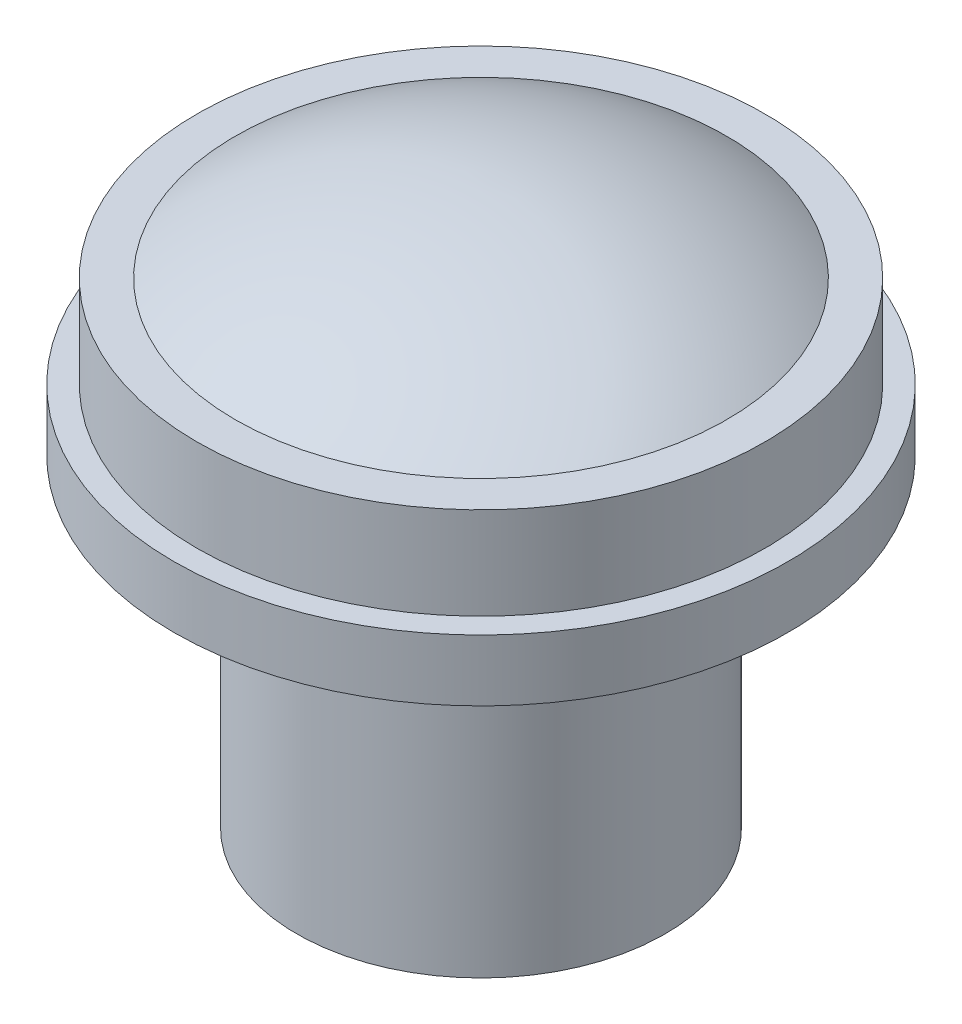
ISO-10303-21;
HEADER;
FILE_DESCRIPTION(('STEP AP214'),'2;1');
FILE_NAME('part.step','',(''),(''),'','','');
FILE_SCHEMA(('AUTOMOTIVE_DESIGN { 1 0 10303 214 1 1 1 1 }'));
ENDSEC;
DATA;
#1=APPLICATION_CONTEXT('core data for automotive mechanical design processes');
#2=APPLICATION_PROTOCOL_DEFINITION('international standard','automotive_design',2000,#1);
#3=PRODUCT_CONTEXT('',#1,'mechanical');
#4=PRODUCT('Part','Part','',(#3));
#5=PRODUCT_RELATED_PRODUCT_CATEGORY('part','',(#4));
#6=PRODUCT_DEFINITION_FORMATION('','',#4);
#7=PRODUCT_DEFINITION_CONTEXT('part definition',#1,'design');
#8=PRODUCT_DEFINITION('design','',#6,#7);
#9=PRODUCT_DEFINITION_SHAPE('','',#8);
#10=(LENGTH_UNIT() NAMED_UNIT(*) SI_UNIT(.MILLI.,.METRE.));
#11=(NAMED_UNIT(*) PLANE_ANGLE_UNIT() SI_UNIT($,.RADIAN.));
#12=(NAMED_UNIT(*) SI_UNIT($,.STERADIAN.) SOLID_ANGLE_UNIT());
#13=UNCERTAINTY_MEASURE_WITH_UNIT(LENGTH_MEASURE(1.E-05),#10,'distance_accuracy_value','');
#14=(GEOMETRIC_REPRESENTATION_CONTEXT(3) GLOBAL_UNCERTAINTY_ASSIGNED_CONTEXT((#13)) GLOBAL_UNIT_ASSIGNED_CONTEXT((#10,
#11,#12)) REPRESENTATION_CONTEXT('',''));
#15=CARTESIAN_POINT('',(0.,0.,0.));
#16=DIRECTION('',(0.,0.,1.));
#17=DIRECTION('',(1.,0.,0.));
#18=AXIS2_PLACEMENT_3D('',#15,#16,#17);
#19=CARTESIAN_POINT('',(0.,12.5,0.));
#20=DIRECTION('',(0.,-1.,0.));
#21=DIRECTION('',(0.,0.,-1.));
#22=AXIS2_PLACEMENT_3D('',#19,#20,#21);
#23=CYLINDRICAL_SURFACE('',#22,9.25);
#24=CARTESIAN_POINT('',(0.,12.5,0.));
#25=DIRECTION('',(0.,1.,0.));
#26=DIRECTION('',(0.,0.,1.));
#27=AXIS2_PLACEMENT_3D('',#24,#25,#26);
#28=CIRCLE('',#27,9.25);
#29=CARTESIAN_POINT('',(0.,12.5,9.25));
#30=VERTEX_POINT('',#29);
#31=EDGE_CURVE('E84',#30,#30,#28,.T.);
#32=ORIENTED_EDGE('',*,*,#31,.T.);
#33=EDGE_LOOP('',(#32));
#34=FACE_BOUND('',#33,.T.);
#35=CARTESIAN_POINT('',(0.,10.5,0.));
#36=DIRECTION('',(0.,1.,0.));
#37=DIRECTION('',(0.,0.,1.));
#38=AXIS2_PLACEMENT_3D('',#35,#36,#37);
#39=CIRCLE('',#38,9.25);
#40=CARTESIAN_POINT('',(0.,10.5,9.25));
#41=VERTEX_POINT('',#40);
#42=EDGE_CURVE('E90',#41,#41,#39,.T.);
#43=ORIENTED_EDGE('',*,*,#42,.F.);
#44=EDGE_LOOP('',(#43));
#45=FACE_BOUND('',#44,.T.);
#46=ADVANCED_FACE('F77',(#34,#45),#23,.F.);
#47=CARTESIAN_POINT('',(0.,12.5,0.));
#48=DIRECTION('',(0.,-1.,0.));
#49=DIRECTION('',(0.,0.,-1.));
#50=AXIS2_PLACEMENT_3D('',#47,#48,#49);
#51=CYLINDRICAL_SURFACE('',#50,10.);
#52=CARTESIAN_POINT('',(0.,12.5,0.));
#53=DIRECTION('',(0.,1.,0.));
#54=DIRECTION('',(0.,0.,1.));
#55=AXIS2_PLACEMENT_3D('',#52,#53,#54);
#56=CIRCLE('',#55,10.);
#57=CARTESIAN_POINT('',(0.,12.5,10.));
#58=VERTEX_POINT('',#57);
#59=EDGE_CURVE('E50',#58,#58,#56,.T.);
#60=ORIENTED_EDGE('',*,*,#59,.F.);
#61=EDGE_LOOP('',(#60));
#62=FACE_BOUND('',#61,.T.);
#63=CARTESIAN_POINT('',(0.,10.5,0.));
#64=DIRECTION('',(0.,1.,0.));
#65=DIRECTION('',(0.,0.,1.));
#66=AXIS2_PLACEMENT_3D('',#63,#64,#65);
#67=CIRCLE('',#66,10.);
#68=CARTESIAN_POINT('',(0.,10.5,10.));
#69=VERTEX_POINT('',#68);
#70=EDGE_CURVE('E80',#69,#69,#67,.T.);
#71=ORIENTED_EDGE('',*,*,#70,.T.);
#72=EDGE_LOOP('',(#71));
#73=FACE_BOUND('',#72,.T.);
#74=ADVANCED_FACE('F97',(#62,#73),#51,.T.);
#75=CARTESIAN_POINT('',(0.,12.5,0.));
#76=DIRECTION('',(0.,1.,0.));
#77=DIRECTION('',(0.,0.,1.));
#78=AXIS2_PLACEMENT_3D('',#75,#76,#77);
#79=PLANE('',#78);
#80=ORIENTED_EDGE('',*,*,#31,.F.);
#81=EDGE_LOOP('',(#80));
#82=FACE_BOUND('',#81,.T.);
#83=ORIENTED_EDGE('',*,*,#59,.T.);
#84=EDGE_LOOP('',(#83));
#85=FACE_BOUND('',#84,.T.);
#86=ADVANCED_FACE('F101',(#82,#85),#79,.T.);
#87=CARTESIAN_POINT('',(0.,10.5,0.));
#88=DIRECTION('',(0.,1.,0.));
#89=DIRECTION('',(0.,0.,1.));
#90=AXIS2_PLACEMENT_3D('',#87,#88,#89);
#91=PLANE('',#90);
#92=ORIENTED_EDGE('',*,*,#42,.T.);
#93=EDGE_LOOP('',(#92));
#94=FACE_BOUND('',#93,.T.);
#95=ORIENTED_EDGE('',*,*,#70,.F.);
#96=EDGE_LOOP('',(#95));
#97=FACE_BOUND('',#96,.T.);
#98=ADVANCED_FACE('F99',(#94,#97),#91,.F.);
#99=CLOSED_SHELL('',(#46,#74,#86,#98));
#100=MANIFOLD_SOLID_BREP('B6',#99);
#101=CARTESIAN_POINT('',(0.,10.4,0.));
#102=DIRECTION('',(0.,1.,0.));
#103=DIRECTION('',(0.,0.,1.));
#104=AXIS2_PLACEMENT_3D('',#101,#102,#103);
#105=CYLINDRICAL_SURFACE('',#104,2.25);
#106=CARTESIAN_POINT('',(0.,10.4,0.));
#107=DIRECTION('',(0.,1.,0.));
#108=DIRECTION('',(0.,0.,1.));
#109=AXIS2_PLACEMENT_3D('',#106,#107,#108);
#110=CIRCLE('',#109,2.25);
#111=CARTESIAN_POINT('',(0.,10.4,2.25));
#112=VERTEX_POINT('',#111);
#113=EDGE_CURVE('E76',#112,#112,#110,.F.);
#114=ORIENTED_EDGE('',*,*,#113,.F.);
#115=EDGE_LOOP('',(#114));
#116=FACE_BOUND('',#115,.T.);
#117=CARTESIAN_POINT('',(0.,10.5,0.));
#118=DIRECTION('',(0.,1.,0.));
#119=DIRECTION('',(0.,0.,1.));
#120=AXIS2_PLACEMENT_3D('',#117,#118,#119);
#121=CIRCLE('',#120,2.25);
#122=CARTESIAN_POINT('',(0.,10.5,2.25));
#123=VERTEX_POINT('',#122);
#124=EDGE_CURVE('E150',#123,#123,#121,.F.);
#125=ORIENTED_EDGE('',*,*,#124,.T.);
#126=EDGE_LOOP('',(#125));
#127=FACE_BOUND('',#126,.T.);
#128=ADVANCED_FACE('F146',(#116,#127),#105,.T.);
#129=CARTESIAN_POINT('',(0.,10.4,0.));
#130=DIRECTION('',(0.,1.,0.));
#131=DIRECTION('',(0.,0.,1.));
#132=AXIS2_PLACEMENT_3D('',#129,#130,#131);
#133=PLANE('',#132);
#134=ORIENTED_EDGE('',*,*,#113,.T.);
#135=EDGE_LOOP('',(#134));
#136=FACE_BOUND('',#135,.T.);
#137=ADVANCED_FACE('F161',(#136),#133,.F.);
#138=CARTESIAN_POINT('',(0.,10.7375,0.));
#139=DIRECTION('',(0.,0.,1.));
#140=DIRECTION('',(1.,0.,0.));
#141=AXIS2_PLACEMENT_3D('',#138,#139,#140);
#142=SPHERICAL_SURFACE('',#141,2.2625);
#143=CARTESIAN_POINT('',(0.,10.7375,0.));
#144=DIRECTION('',(0.,1.,0.));
#145=DIRECTION('',(0.,0.,1.));
#146=AXIS2_PLACEMENT_3D('',#143,#144,#145);
#147=SPHERICAL_SURFACE('',#146,2.2625);
#148=ORIENTED_EDGE('',*,*,#124,.F.);
#149=EDGE_LOOP('',(#148));
#150=FACE_BOUND('',#149,.T.);
#151=ADVANCED_FACE('F148',(#150),#147,.T.);
#152=CLOSED_SHELL('',(#128,#137,#151));
#153=MANIFOLD_SOLID_BREP('B45',#152);
#154=CARTESIAN_POINT('',(0.,15.5,0.));
#155=DIRECTION('',(0.,-1.,0.));
#156=DIRECTION('',(0.,0.,-1.));
#157=AXIS2_PLACEMENT_3D('',#154,#155,#156);
#158=CYLINDRICAL_SURFACE('',#157,8.);
#159=CARTESIAN_POINT('',(0.,15.5,0.));
#160=DIRECTION('',(0.,1.,0.));
#161=DIRECTION('',(0.,0.,1.));
#162=AXIS2_PLACEMENT_3D('',#159,#160,#161);
#163=CIRCLE('',#162,8.);
#164=CARTESIAN_POINT('',(0.,15.5,8.));
#165=VERTEX_POINT('',#164);
#166=EDGE_CURVE('E145',#165,#165,#163,.T.);
#167=ORIENTED_EDGE('',*,*,#166,.F.);
#168=EDGE_LOOP('',(#167));
#169=FACE_BOUND('',#168,.T.);
#170=CARTESIAN_POINT('',(0.,10.5,0.));
#171=DIRECTION('',(0.,1.,0.));
#172=DIRECTION('',(0.,0.,1.));
#173=AXIS2_PLACEMENT_3D('',#170,#171,#172);
#174=CIRCLE('',#173,8.);
#175=CARTESIAN_POINT('',(0.,10.5,8.));
#176=VERTEX_POINT('',#175);
#177=EDGE_CURVE('E204',#176,#176,#174,.T.);
#178=ORIENTED_EDGE('',*,*,#177,.T.);
#179=EDGE_LOOP('',(#178));
#180=FACE_BOUND('',#179,.T.);
#181=ADVANCED_FACE('F197',(#169,#180),#158,.T.);
#182=CARTESIAN_POINT('',(0.,3.95,0.));
#183=DIRECTION('',(0.,0.,1.));
#184=DIRECTION('',(1.,0.,0.));
#185=AXIS2_PLACEMENT_3D('',#182,#183,#184);
#186=SPHERICAL_SURFACE('',#185,14.05);
#187=CARTESIAN_POINT('',(0.,3.95,0.));
#188=DIRECTION('',(0.,1.,0.));
#189=DIRECTION('',(0.,0.,1.));
#190=AXIS2_PLACEMENT_3D('',#187,#188,#189);
#191=SPHERICAL_SURFACE('',#190,14.05);
#192=ORIENTED_EDGE('',*,*,#166,.T.);
#193=EDGE_LOOP('',(#192));
#194=FACE_BOUND('',#193,.T.);
#195=ADVANCED_FACE('F199',(#194),#191,.T.);
#196=CARTESIAN_POINT('',(0.,10.5,0.));
#197=DIRECTION('',(0.,1.,0.));
#198=DIRECTION('',(0.,0.,1.));
#199=AXIS2_PLACEMENT_3D('',#196,#197,#198);
#200=PLANE('',#199);
#201=ORIENTED_EDGE('',*,*,#177,.F.);
#202=EDGE_LOOP('',(#201));
#203=FACE_BOUND('',#202,.T.);
#204=ADVANCED_FACE('F211',(#203),#200,.F.);
#205=CLOSED_SHELL('',(#181,#195,#204));
#206=MANIFOLD_SOLID_BREP('B71',#205);
#207=CARTESIAN_POINT('',(0.,15.5,0.));
#208=DIRECTION('',(0.,-1.,0.));
#209=DIRECTION('',(0.,0.,-1.));
#210=AXIS2_PLACEMENT_3D('',#207,#208,#209);
#211=CYLINDRICAL_SURFACE('',#210,8.);
#212=CARTESIAN_POINT('',(0.,15.5,0.));
#213=DIRECTION('',(0.,1.,0.));
#214=DIRECTION('',(0.,0.,1.));
#215=AXIS2_PLACEMENT_3D('',#212,#213,#214);
#216=CIRCLE('',#215,8.);
#217=CARTESIAN_POINT('',(0.,15.5,8.));
#218=VERTEX_POINT('',#217);
#219=EDGE_CURVE('E251',#218,#218,#216,.T.);
#220=ORIENTED_EDGE('',*,*,#219,.T.);
#221=EDGE_LOOP('',(#220));
#222=FACE_BOUND('',#221,.T.);
#223=CARTESIAN_POINT('',(0.,10.5,0.));
#224=DIRECTION('',(0.,1.,0.));
#225=DIRECTION('',(0.,0.,1.));
#226=AXIS2_PLACEMENT_3D('',#223,#224,#225);
#227=CIRCLE('',#226,8.);
#228=CARTESIAN_POINT('',(0.,10.5,8.));
#229=VERTEX_POINT('',#228);
#230=EDGE_CURVE('E257',#229,#229,#227,.T.);
#231=ORIENTED_EDGE('',*,*,#230,.F.);
#232=EDGE_LOOP('',(#231));
#233=FACE_BOUND('',#232,.T.);
#234=ADVANCED_FACE('F244',(#222,#233),#211,.F.);
#235=CARTESIAN_POINT('',(0.,15.5,0.));
#236=DIRECTION('',(0.,-1.,0.));
#237=DIRECTION('',(0.,0.,-1.));
#238=AXIS2_PLACEMENT_3D('',#235,#236,#237);
#239=CYLINDRICAL_SURFACE('',#238,9.25);
#240=CARTESIAN_POINT('',(0.,15.5,0.));
#241=DIRECTION('',(0.,1.,0.));
#242=DIRECTION('',(0.,0.,1.));
#243=AXIS2_PLACEMENT_3D('',#240,#241,#242);
#244=CIRCLE('',#243,9.25);
#245=CARTESIAN_POINT('',(0.,15.5,9.25));
#246=VERTEX_POINT('',#245);
#247=EDGE_CURVE('E196',#246,#246,#244,.T.);
#248=ORIENTED_EDGE('',*,*,#247,.F.);
#249=EDGE_LOOP('',(#248));
#250=FACE_BOUND('',#249,.T.);
#251=CARTESIAN_POINT('',(0.,10.5,0.));
#252=DIRECTION('',(0.,1.,0.));
#253=DIRECTION('',(0.,0.,1.));
#254=AXIS2_PLACEMENT_3D('',#251,#252,#253);
#255=CIRCLE('',#254,9.25);
#256=CARTESIAN_POINT('',(0.,10.5,9.25));
#257=VERTEX_POINT('',#256);
#258=EDGE_CURVE('E247',#257,#257,#255,.T.);
#259=ORIENTED_EDGE('',*,*,#258,.T.);
#260=EDGE_LOOP('',(#259));
#261=FACE_BOUND('',#260,.T.);
#262=ADVANCED_FACE('F264',(#250,#261),#239,.T.);
#263=CARTESIAN_POINT('',(0.,15.5,0.));
#264=DIRECTION('',(0.,1.,0.));
#265=DIRECTION('',(0.,0.,1.));
#266=AXIS2_PLACEMENT_3D('',#263,#264,#265);
#267=PLANE('',#266);
#268=ORIENTED_EDGE('',*,*,#219,.F.);
#269=EDGE_LOOP('',(#268));
#270=FACE_BOUND('',#269,.T.);
#271=ORIENTED_EDGE('',*,*,#247,.T.);
#272=EDGE_LOOP('',(#271));
#273=FACE_BOUND('',#272,.T.);
#274=ADVANCED_FACE('F268',(#270,#273),#267,.T.);
#275=CARTESIAN_POINT('',(0.,10.5,0.));
#276=DIRECTION('',(0.,1.,0.));
#277=DIRECTION('',(0.,0.,1.));
#278=AXIS2_PLACEMENT_3D('',#275,#276,#277);
#279=PLANE('',#278);
#280=ORIENTED_EDGE('',*,*,#230,.T.);
#281=EDGE_LOOP('',(#280));
#282=FACE_BOUND('',#281,.T.);
#283=ORIENTED_EDGE('',*,*,#258,.F.);
#284=EDGE_LOOP('',(#283));
#285=FACE_BOUND('',#284,.T.);
#286=ADVANCED_FACE('F266',(#282,#285),#279,.F.);
#287=CLOSED_SHELL('',(#234,#262,#274,#286));
#288=MANIFOLD_SOLID_BREP('B140',#287);
#289=CARTESIAN_POINT('',(0.,10.5,0.));
#290=DIRECTION('',(0.,1.,0.));
#291=DIRECTION('',(0.,0.,1.));
#292=AXIS2_PLACEMENT_3D('',#289,#290,#291);
#293=PLANE('',#292);
#294=CARTESIAN_POINT('',(0.,10.5,0.));
#295=DIRECTION('',(0.,1.,0.));
#296=DIRECTION('',(0.,0.,1.));
#297=AXIS2_PLACEMENT_3D('',#294,#295,#296);
#298=CIRCLE('',#297,6.);
#299=CARTESIAN_POINT('',(0.,10.5,-6.));
#300=VERTEX_POINT('',#299);
#301=EDGE_CURVE('E243',#300,#300,#298,.T.);
#302=ORIENTED_EDGE('',*,*,#301,.T.);
#303=EDGE_LOOP('',(#302));
#304=FACE_BOUND('',#303,.T.);
#305=CARTESIAN_POINT('',(0.,10.5,0.));
#306=DIRECTION('',(0.,1.,0.));
#307=DIRECTION('',(0.,0.,1.));
#308=AXIS2_PLACEMENT_3D('',#305,#306,#307);
#309=CIRCLE('',#308,2.25);
#310=CARTESIAN_POINT('',(0.,10.5,-2.25));
#311=VERTEX_POINT('',#310);
#312=EDGE_CURVE('E316',#311,#311,#309,.T.);
#313=ORIENTED_EDGE('',*,*,#312,.F.);
#314=EDGE_LOOP('',(#313));
#315=FACE_BOUND('',#314,.T.);
#316=ADVANCED_FACE('F305',(#304,#315),#293,.T.);
#317=CARTESIAN_POINT('',(0.,0.,0.));
#318=DIRECTION('',(0.,1.,0.));
#319=DIRECTION('',(0.,0.,1.));
#320=AXIS2_PLACEMENT_3D('',#317,#318,#319);
#321=PLANE('',#320);
#322=CARTESIAN_POINT('',(0.,0.,0.));
#323=DIRECTION('',(0.,1.,0.));
#324=DIRECTION('',(0.,0.,1.));
#325=AXIS2_PLACEMENT_3D('',#322,#323,#324);
#326=CIRCLE('',#325,6.);
#327=CARTESIAN_POINT('',(0.,0.,-6.));
#328=VERTEX_POINT('',#327);
#329=EDGE_CURVE('E309',#328,#328,#326,.T.);
#330=ORIENTED_EDGE('',*,*,#329,.F.);
#331=EDGE_LOOP('',(#330));
#332=FACE_BOUND('',#331,.T.);
#333=CARTESIAN_POINT('',(0.,0.,0.));
#334=DIRECTION('',(0.,1.,0.));
#335=DIRECTION('',(0.,0.,1.));
#336=AXIS2_PLACEMENT_3D('',#333,#334,#335);
#337=CIRCLE('',#336,2.25);
#338=CARTESIAN_POINT('',(0.,0.,-2.25));
#339=VERTEX_POINT('',#338);
#340=EDGE_CURVE('E318',#339,#339,#337,.T.);
#341=ORIENTED_EDGE('',*,*,#340,.T.);
#342=EDGE_LOOP('',(#341));
#343=FACE_BOUND('',#342,.T.);
#344=ADVANCED_FACE('F328',(#332,#343),#321,.F.);
#345=CARTESIAN_POINT('',(0.,10.5,0.));
#346=DIRECTION('',(0.,-1.,0.));
#347=DIRECTION('',(0.,0.,-1.));
#348=AXIS2_PLACEMENT_3D('',#345,#346,#347);
#349=CYLINDRICAL_SURFACE('',#348,6.);
#350=CARTESIAN_POINT('',(0.,10.5,-6.));
#351=CARTESIAN_POINT('',(0.,10.390625,-6.));
#352=CARTESIAN_POINT('',(0.,10.28125,-6.));
#353=CARTESIAN_POINT('',(0.,10.0625,-6.));
#354=CARTESIAN_POINT('',(0.,9.953125,-6.));
#355=CARTESIAN_POINT('',(0.,9.734375,-6.));
#356=CARTESIAN_POINT('',(0.,9.625,-6.));
#357=CARTESIAN_POINT('',(0.,9.40625,-6.));
#358=CARTESIAN_POINT('',(0.,9.296875,-6.));
#359=CARTESIAN_POINT('',(0.,9.078125,-6.));
#360=CARTESIAN_POINT('',(0.,8.96875,-6.));
#361=CARTESIAN_POINT('',(0.,8.75,-6.));
#362=CARTESIAN_POINT('',(0.,8.640625,-6.));
#363=CARTESIAN_POINT('',(0.,8.421875,-6.));
#364=CARTESIAN_POINT('',(0.,8.3125,-6.));
#365=CARTESIAN_POINT('',(0.,8.09375,-6.));
#366=CARTESIAN_POINT('',(0.,7.984375,-6.));
#367=CARTESIAN_POINT('',(0.,7.765625,-6.));
#368=CARTESIAN_POINT('',(0.,7.65625,-6.));
#369=CARTESIAN_POINT('',(0.,7.4375,-6.));
#370=CARTESIAN_POINT('',(0.,7.328125,-6.));
#371=CARTESIAN_POINT('',(0.,7.109375,-6.));
#372=CARTESIAN_POINT('',(0.,7.,-6.));
#373=CARTESIAN_POINT('',(0.,6.78125,-6.));
#374=CARTESIAN_POINT('',(0.,6.671875,-6.));
#375=CARTESIAN_POINT('',(0.,6.453125,-6.));
#376=CARTESIAN_POINT('',(0.,6.34375,-6.));
#377=CARTESIAN_POINT('',(0.,6.125,-6.));
#378=CARTESIAN_POINT('',(0.,6.015625,-6.));
#379=CARTESIAN_POINT('',(0.,5.796875,-6.));
#380=CARTESIAN_POINT('',(0.,5.6875,-6.));
#381=CARTESIAN_POINT('',(0.,5.46875,-6.));
#382=CARTESIAN_POINT('',(0.,5.359375,-6.));
#383=CARTESIAN_POINT('',(0.,5.140625,-6.));
#384=CARTESIAN_POINT('',(0.,5.03125,-6.));
#385=CARTESIAN_POINT('',(0.,4.8125,-6.));
#386=CARTESIAN_POINT('',(0.,4.703125,-6.));
#387=CARTESIAN_POINT('',(0.,4.484375,-6.));
#388=CARTESIAN_POINT('',(0.,4.375,-6.));
#389=CARTESIAN_POINT('',(0.,4.15625,-6.));
#390=CARTESIAN_POINT('',(0.,4.046875,-6.));
#391=CARTESIAN_POINT('',(0.,3.828125,-6.));
#392=CARTESIAN_POINT('',(0.,3.71875,-6.));
#393=CARTESIAN_POINT('',(0.,3.5,-6.));
#394=CARTESIAN_POINT('',(0.,3.390625,-6.));
#395=CARTESIAN_POINT('',(0.,3.171875,-6.));
#396=CARTESIAN_POINT('',(0.,3.0625,-6.));
#397=CARTESIAN_POINT('',(0.,2.84375,-6.));
#398=CARTESIAN_POINT('',(0.,2.734375,-6.));
#399=CARTESIAN_POINT('',(0.,2.515625,-6.));
#400=CARTESIAN_POINT('',(0.,2.40625,-6.));
#401=CARTESIAN_POINT('',(0.,2.1875,-6.));
#402=CARTESIAN_POINT('',(0.,2.078125,-6.));
#403=CARTESIAN_POINT('',(0.,1.859375,-6.));
#404=CARTESIAN_POINT('',(0.,1.75,-6.));
#405=CARTESIAN_POINT('',(0.,1.53125,-6.));
#406=CARTESIAN_POINT('',(0.,1.421875,-6.));
#407=CARTESIAN_POINT('',(0.,1.203125,-6.));
#408=CARTESIAN_POINT('',(0.,1.09375,-6.));
#409=CARTESIAN_POINT('',(0.,0.875000000000001,-6.));
#410=CARTESIAN_POINT('',(0.,0.765625000000001,-6.));
#411=CARTESIAN_POINT('',(0.,0.546875,-6.));
#412=CARTESIAN_POINT('',(0.,0.4375,-6.));
#413=CARTESIAN_POINT('',(0.,0.21875,-6.));
#414=CARTESIAN_POINT('',(0.,0.109375,-6.));
#415=CARTESIAN_POINT('',(0.,0.,-6.));
#416=B_SPLINE_CURVE_WITH_KNOTS('',3,(#350,#351,#352,#353,#354,#355,#356,#357,#358,#359,#360,
#361,#362,#363,#364,#365,#366,#367,#368,#369,#370,#371,#372,#373,#374,#375,#376,#377,#378,#379,
#380,#381,#382,#383,#384,#385,#386,#387,#388,#389,#390,#391,#392,#393,#394,#395,#396,#397,#398,
#399,#400,#401,#402,#403,#404,#405,#406,#407,#408,#409,#410,#411,#412,#413,#414,#415),
.UNSPECIFIED.,.F.,.F.,(4,2,2,2,2,2,2,2,2,2,2,2,2,2,2,2,2,2,2,2,2,2,2,2,2,2,2,2,2,2,2,2,4),(0.,
0.328124999999999,0.656249999999999,0.984374999999999,1.3125,1.640625,1.96875,2.296875,2.625,
2.953125,3.28125,3.609375,3.9375,4.265625,4.59375,4.921875,5.25,5.578125,5.90625,6.234375,
6.5625,6.890625,7.21875,7.546875,7.875,8.203125,8.53125,8.859375,9.1875,9.515625,9.84375,
10.171875,10.5),.UNSPECIFIED.);
#417=EDGE_CURVE('BSEAM307',#300,#328,#416,.T.);
#418=ORIENTED_EDGE('',*,*,#301,.F.);
#419=ORIENTED_EDGE('',*,*,#329,.T.);
#420=ORIENTED_EDGE('',*,*,#417,.T.);
#421=ORIENTED_EDGE('',*,*,#417,.F.);
#422=EDGE_LOOP('',(#418,#420,#419,#421));
#423=FACE_BOUND('',#422,.T.);
#424=ADVANCED_FACE('F307',(#423),#349,.T.);
#425=CARTESIAN_POINT('',(0.,10.5,0.));
#426=DIRECTION('',(0.,-1.,0.));
#427=DIRECTION('',(0.,0.,-1.));
#428=AXIS2_PLACEMENT_3D('',#425,#426,#427);
#429=CYLINDRICAL_SURFACE('',#428,2.25);
#430=CARTESIAN_POINT('',(0.,10.5,-2.25));
#431=CARTESIAN_POINT('',(0.,10.390625,-2.25));
#432=CARTESIAN_POINT('',(0.,10.28125,-2.25));
#433=CARTESIAN_POINT('',(0.,10.0625,-2.25));
#434=CARTESIAN_POINT('',(0.,9.953125,-2.25));
#435=CARTESIAN_POINT('',(0.,9.734375,-2.25));
#436=CARTESIAN_POINT('',(0.,9.625,-2.25));
#437=CARTESIAN_POINT('',(0.,9.40625,-2.25));
#438=CARTESIAN_POINT('',(0.,9.296875,-2.25));
#439=CARTESIAN_POINT('',(0.,9.078125,-2.25));
#440=CARTESIAN_POINT('',(0.,8.96875,-2.25));
#441=CARTESIAN_POINT('',(0.,8.75,-2.25));
#442=CARTESIAN_POINT('',(0.,8.640625,-2.25));
#443=CARTESIAN_POINT('',(0.,8.421875,-2.25));
#444=CARTESIAN_POINT('',(0.,8.3125,-2.25));
#445=CARTESIAN_POINT('',(0.,8.09375,-2.25));
#446=CARTESIAN_POINT('',(0.,7.984375,-2.25));
#447=CARTESIAN_POINT('',(0.,7.765625,-2.25));
#448=CARTESIAN_POINT('',(0.,7.65625,-2.25));
#449=CARTESIAN_POINT('',(0.,7.4375,-2.25));
#450=CARTESIAN_POINT('',(0.,7.328125,-2.25));
#451=CARTESIAN_POINT('',(0.,7.109375,-2.25));
#452=CARTESIAN_POINT('',(0.,7.,-2.25));
#453=CARTESIAN_POINT('',(0.,6.78125,-2.25));
#454=CARTESIAN_POINT('',(0.,6.671875,-2.25));
#455=CARTESIAN_POINT('',(0.,6.453125,-2.25));
#456=CARTESIAN_POINT('',(0.,6.34375,-2.25));
#457=CARTESIAN_POINT('',(0.,6.125,-2.25));
#458=CARTESIAN_POINT('',(0.,6.015625,-2.25));
#459=CARTESIAN_POINT('',(0.,5.796875,-2.25));
#460=CARTESIAN_POINT('',(0.,5.6875,-2.25));
#461=CARTESIAN_POINT('',(0.,5.46875,-2.25));
#462=CARTESIAN_POINT('',(0.,5.359375,-2.25));
#463=CARTESIAN_POINT('',(0.,5.140625,-2.25));
#464=CARTESIAN_POINT('',(0.,5.03125,-2.25));
#465=CARTESIAN_POINT('',(0.,4.8125,-2.25));
#466=CARTESIAN_POINT('',(0.,4.703125,-2.25));
#467=CARTESIAN_POINT('',(0.,4.484375,-2.25));
#468=CARTESIAN_POINT('',(0.,4.375,-2.25));
#469=CARTESIAN_POINT('',(0.,4.15625,-2.25));
#470=CARTESIAN_POINT('',(0.,4.046875,-2.25));
#471=CARTESIAN_POINT('',(0.,3.828125,-2.25));
#472=CARTESIAN_POINT('',(0.,3.71875,-2.25));
#473=CARTESIAN_POINT('',(0.,3.5,-2.25));
#474=CARTESIAN_POINT('',(0.,3.390625,-2.25));
#475=CARTESIAN_POINT('',(0.,3.171875,-2.25));
#476=CARTESIAN_POINT('',(0.,3.0625,-2.25));
#477=CARTESIAN_POINT('',(0.,2.84375,-2.25));
#478=CARTESIAN_POINT('',(0.,2.734375,-2.25));
#479=CARTESIAN_POINT('',(0.,2.515625,-2.25));
#480=CARTESIAN_POINT('',(0.,2.40625,-2.25));
#481=CARTESIAN_POINT('',(0.,2.1875,-2.25));
#482=CARTESIAN_POINT('',(0.,2.078125,-2.25));
#483=CARTESIAN_POINT('',(0.,1.859375,-2.25));
#484=CARTESIAN_POINT('',(0.,1.75,-2.25));
#485=CARTESIAN_POINT('',(0.,1.53125,-2.25));
#486=CARTESIAN_POINT('',(0.,1.421875,-2.25));
#487=CARTESIAN_POINT('',(0.,1.203125,-2.25));
#488=CARTESIAN_POINT('',(0.,1.09375,-2.25));
#489=CARTESIAN_POINT('',(0.,0.875000000000001,-2.25));
#490=CARTESIAN_POINT('',(0.,0.765625000000001,-2.25));
#491=CARTESIAN_POINT('',(0.,0.546875,-2.25));
#492=CARTESIAN_POINT('',(0.,0.4375,-2.25));
#493=CARTESIAN_POINT('',(0.,0.21875,-2.25));
#494=CARTESIAN_POINT('',(0.,0.109375,-2.25));
#495=CARTESIAN_POINT('',(0.,0.,-2.25));
#496=B_SPLINE_CURVE_WITH_KNOTS('',3,(#430,#431,#432,#433,#434,#435,#436,#437,#438,#439,#440,
#441,#442,#443,#444,#445,#446,#447,#448,#449,#450,#451,#452,#453,#454,#455,#456,#457,#458,#459,
#460,#461,#462,#463,#464,#465,#466,#467,#468,#469,#470,#471,#472,#473,#474,#475,#476,#477,#478,
#479,#480,#481,#482,#483,#484,#485,#486,#487,#488,#489,#490,#491,#492,#493,#494,#495),
.UNSPECIFIED.,.F.,.F.,(4,2,2,2,2,2,2,2,2,2,2,2,2,2,2,2,2,2,2,2,2,2,2,2,2,2,2,2,2,2,2,2,4),(0.,
0.328125,0.656250000000001,0.984375000000001,1.3125,1.640625,1.96875,2.296875,2.625,2.953125,
3.28125,3.609375,3.9375,4.265625,4.59375,4.921875,5.25,5.578125,5.90625,6.234375,6.5625,
6.890625,7.21875,7.546875,7.875,8.203125,8.53125,8.859375,9.1875,9.515625,9.84375,10.171875,
10.5),.UNSPECIFIED.);
#497=EDGE_CURVE('BSEAM324',#311,#339,#496,.T.);
#498=ORIENTED_EDGE('',*,*,#312,.T.);
#499=ORIENTED_EDGE('',*,*,#340,.F.);
#500=ORIENTED_EDGE('',*,*,#497,.T.);
#501=ORIENTED_EDGE('',*,*,#497,.F.);
#502=EDGE_LOOP('',(#498,#500,#499,#501));
#503=FACE_BOUND('',#502,.T.);
#504=ADVANCED_FACE('F324',(#503),#429,.F.);
#505=CLOSED_SHELL('',(#316,#344,#424,#504));
#506=MANIFOLD_SOLID_BREP('B191',#505);
#507=ADVANCED_BREP_SHAPE_REPRESENTATION('',(#18,#100,#153,#206,#288,#506),#14);
#508=SHAPE_DEFINITION_REPRESENTATION(#9,#507);
ENDSEC;
END-ISO-10303-21;
